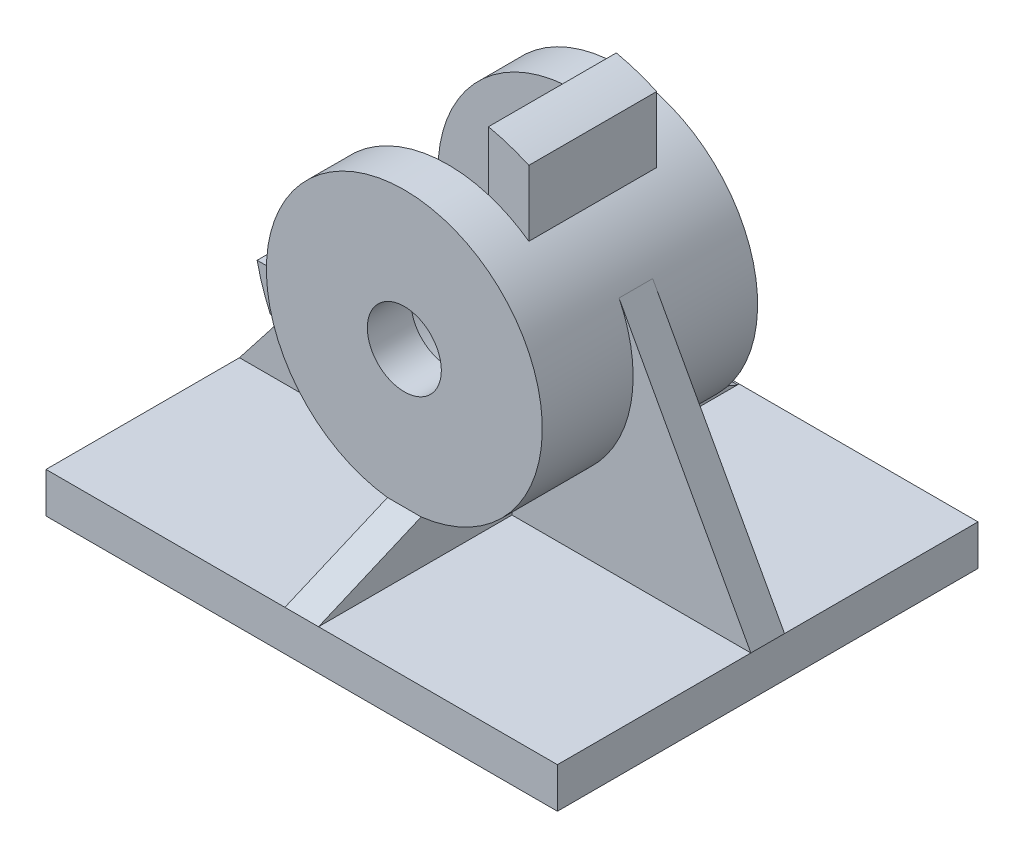
ISO-10303-21;
HEADER;
FILE_DESCRIPTION(('STEP AP214'),'2;1');
FILE_NAME('part.step','',(''),(''),'','','');
FILE_SCHEMA(('AUTOMOTIVE_DESIGN { 1 0 10303 214 1 1 1 1 }'));
ENDSEC;
DATA;
#1=APPLICATION_CONTEXT('core data for automotive mechanical design processes');
#2=APPLICATION_PROTOCOL_DEFINITION('international standard','automotive_design',2000,#1);
#3=PRODUCT_CONTEXT('',#1,'mechanical');
#4=PRODUCT('Part','Part','',(#3));
#5=PRODUCT_RELATED_PRODUCT_CATEGORY('part','',(#4));
#6=PRODUCT_DEFINITION_FORMATION('','',#4);
#7=PRODUCT_DEFINITION_CONTEXT('part definition',#1,'design');
#8=PRODUCT_DEFINITION('design','',#6,#7);
#9=PRODUCT_DEFINITION_SHAPE('','',#8);
#10=(LENGTH_UNIT() NAMED_UNIT(*) SI_UNIT(.MILLI.,.METRE.));
#11=(NAMED_UNIT(*) PLANE_ANGLE_UNIT() SI_UNIT($,.RADIAN.));
#12=(NAMED_UNIT(*) SI_UNIT($,.STERADIAN.) SOLID_ANGLE_UNIT());
#13=UNCERTAINTY_MEASURE_WITH_UNIT(LENGTH_MEASURE(1.E-05),#10,'distance_accuracy_value','');
#14=(GEOMETRIC_REPRESENTATION_CONTEXT(3) GLOBAL_UNCERTAINTY_ASSIGNED_CONTEXT((#13)) GLOBAL_UNIT_ASSIGNED_CONTEXT((#10,
#11,#12)) REPRESENTATION_CONTEXT('',''));
#15=CARTESIAN_POINT('',(0.,0.,0.));
#16=DIRECTION('',(0.,0.,1.));
#17=DIRECTION('',(1.,0.,0.));
#18=AXIS2_PLACEMENT_3D('',#15,#16,#17);
#19=CARTESIAN_POINT('',(76.,65.7098997643715,81.5));
#20=DIRECTION('',(0.,0.,-1.));
#21=DIRECTION('',(-1.,0.,0.));
#22=AXIS2_PLACEMENT_3D('',#19,#20,#21);
#23=PLANE('',#22);
#24=CARTESIAN_POINT('',(76.,65.7098997643715,81.5));
#25=DIRECTION('',(0.,0.,1.));
#26=DIRECTION('',(1.,0.,0.));
#27=AXIS2_PLACEMENT_3D('',#24,#25,#26);
#28=CIRCLE('',#27,41.);
#29=CARTESIAN_POINT('',(100.,98.9514400415608,81.5));
#30=VERTEX_POINT('',#29);
#31=CARTESIAN_POINT('',(88.,104.914491332197,81.5));
#32=VERTEX_POINT('',#31);
#33=EDGE_CURVE('E326',#30,#32,#28,.T.);
#34=ORIENTED_EDGE('',*,*,#33,.F.);
#35=DIRECTION('',(0.,-1.,0.));
#36=VECTOR('',#35,1.);
#37=CARTESIAN_POINT('',(100.,0.,81.5));
#38=LINE('',#37,#36);
#39=CARTESIAN_POINT('',(100.,118.511414894148,81.5));
#40=VERTEX_POINT('',#39);
#41=EDGE_CURVE('E880',#40,#30,#38,.T.);
#42=ORIENTED_EDGE('',*,*,#41,.F.);
#43=CARTESIAN_POINT('',(76.,65.7098997643715,81.5));
#44=DIRECTION('',(0.,0.,-1.));
#45=DIRECTION('',(-1.,0.,0.));
#46=AXIS2_PLACEMENT_3D('',#43,#44,#45);
#47=CIRCLE('',#46,58.);
#48=CARTESIAN_POINT('',(88.,122.454943600816,81.5));
#49=VERTEX_POINT('',#48);
#50=EDGE_CURVE('E422',#49,#40,#47,.T.);
#51=ORIENTED_EDGE('',*,*,#50,.F.);
#52=DIRECTION('',(0.,1.,0.));
#53=VECTOR('',#52,1.);
#54=CARTESIAN_POINT('',(88.,92.1106573292596,81.5));
#55=LINE('',#54,#53);
#56=EDGE_CURVE('E873',#32,#49,#55,.T.);
#57=ORIENTED_EDGE('',*,*,#56,.F.);
#58=EDGE_LOOP('',(#34,#42,#51,#57));
#59=FACE_BOUND('',#58,.T.);
#60=ADVANCED_FACE('F55',(#59),#23,.F.);
#61=CARTESIAN_POINT('',(36.7954084321747,53.7098997643715,81.5));
#62=VERTEX_POINT('',#61);
#63=CARTESIAN_POINT('',(42.7584597228107,41.7098997643715,81.5));
#64=VERTEX_POINT('',#63);
#65=EDGE_CURVE('E582',#62,#64,#28,.T.);
#66=ORIENTED_EDGE('',*,*,#65,.F.);
#67=DIRECTION('',(1.,0.,0.));
#68=VECTOR('',#67,1.);
#69=CARTESIAN_POINT('',(36.7954084321747,53.7098997643715,81.5));
#70=LINE('',#69,#68);
#71=CARTESIAN_POINT('',(19.2549561635556,53.7098997643715,81.5));
#72=VERTEX_POINT('',#71);
#73=EDGE_CURVE('E561',#72,#62,#70,.T.);
#74=ORIENTED_EDGE('',*,*,#73,.F.);
#75=CARTESIAN_POINT('',(76.,65.7098997643715,81.5));
#76=DIRECTION('',(0.,0.,-1.));
#77=DIRECTION('',(-1.,0.,0.));
#78=AXIS2_PLACEMENT_3D('',#75,#76,#77);
#79=CIRCLE('',#78,58.);
#80=CARTESIAN_POINT('',(23.1984848702236,41.7098997643715,81.5));
#81=VERTEX_POINT('',#80);
#82=EDGE_CURVE('E745',#81,#72,#79,.T.);
#83=ORIENTED_EDGE('',*,*,#82,.F.);
#84=DIRECTION('',(1.,0.,0.));
#85=VECTOR('',#84,1.);
#86=CARTESIAN_POINT('',(0.,41.7098997643715,81.5));
#87=LINE('',#86,#85);
#88=EDGE_CURVE('E741',#81,#64,#87,.T.);
#89=ORIENTED_EDGE('',*,*,#88,.T.);
#90=EDGE_LOOP('',(#66,#74,#83,#89));
#91=FACE_BOUND('',#90,.T.);
#92=ADVANCED_FACE('F1045',(#91),#23,.F.);
#93=CARTESIAN_POINT('',(71.,12.,125.));
#94=DIRECTION('',(1.,0.,0.));
#95=DIRECTION('',(0.,0.,-1.));
#96=AXIS2_PLACEMENT_3D('',#93,#94,#95);
#97=PLANE('',#96);
#98=DIRECTION('',(0.,0.,-1.));
#99=VECTOR('',#98,1.);
#100=CARTESIAN_POINT('',(71.,12.,125.));
#101=LINE('',#100,#99);
#102=CARTESIAN_POINT('',(71.,12.,125.));
#103=VERTEX_POINT('',#102);
#104=CARTESIAN_POINT('',(71.,12.,67.5));
#105=VERTEX_POINT('',#104);
#106=EDGE_CURVE('E344',#103,#105,#101,.T.);
#107=ORIENTED_EDGE('',*,*,#106,.F.);
#108=DIRECTION('',(0.,-0.392504670380892,0.919750011540738));
#109=VECTOR('',#108,1.);
#110=CARTESIAN_POINT('',(71.,12.,125.));
#111=LINE('',#110,#109);
#112=CARTESIAN_POINT('',(71.,25.0159198656199,94.5));
#113=VERTEX_POINT('',#112);
#114=EDGE_CURVE('E331',#113,#103,#111,.T.);
#115=ORIENTED_EDGE('',*,*,#114,.F.);
#116=DIRECTION('',(0.,0.,-1.));
#117=VECTOR('',#116,1.);
#118=CARTESIAN_POINT('',(71.,25.0159198656198,81.5));
#119=LINE('',#118,#117);
#120=CARTESIAN_POINT('',(71.,25.0159198656198,67.5));
#121=VERTEX_POINT('',#120);
#122=EDGE_CURVE('E341',#113,#121,#119,.T.);
#123=ORIENTED_EDGE('',*,*,#122,.T.);
#124=DIRECTION('',(0.,-1.,0.));
#125=VECTOR('',#124,1.);
#126=CARTESIAN_POINT('',(71.,12.,67.5));
#127=LINE('',#126,#125);
#128=EDGE_CURVE('E721',#121,#105,#127,.T.);
#129=ORIENTED_EDGE('',*,*,#128,.T.);
#130=EDGE_LOOP('',(#107,#115,#123,#129));
#131=FACE_BOUND('',#130,.T.);
#132=ADVANCED_FACE('F340',(#131),#97,.F.);
#133=CARTESIAN_POINT('',(81.,12.,125.));
#134=DIRECTION('',(-1.,0.,0.));
#135=DIRECTION('',(0.,0.,1.));
#136=AXIS2_PLACEMENT_3D('',#133,#134,#135);
#137=PLANE('',#136);
#138=DIRECTION('',(0.,0.,-1.));
#139=VECTOR('',#138,1.);
#140=CARTESIAN_POINT('',(81.,25.0159198656199,81.5));
#141=LINE('',#140,#139);
#142=CARTESIAN_POINT('',(81.,25.0159198656199,67.5));
#143=VERTEX_POINT('',#142);
#144=CARTESIAN_POINT('',(81.,25.0159198656199,94.5));
#145=VERTEX_POINT('',#144);
#146=EDGE_CURVE('E66',#143,#145,#141,.F.);
#147=ORIENTED_EDGE('',*,*,#146,.T.);
#148=DIRECTION('',(0.,-0.392504670380892,0.919750011540738));
#149=VECTOR('',#148,1.);
#150=CARTESIAN_POINT('',(81.,12.,125.));
#151=LINE('',#150,#149);
#152=CARTESIAN_POINT('',(81.,12.,125.));
#153=VERTEX_POINT('',#152);
#154=EDGE_CURVE('E334',#145,#153,#151,.T.);
#155=ORIENTED_EDGE('',*,*,#154,.T.);
#156=DIRECTION('',(0.,0.,-1.));
#157=VECTOR('',#156,1.);
#158=CARTESIAN_POINT('',(81.,12.,125.));
#159=LINE('',#158,#157);
#160=CARTESIAN_POINT('',(81.,12.,67.5));
#161=VERTEX_POINT('',#160);
#162=EDGE_CURVE('E628',#153,#161,#159,.T.);
#163=ORIENTED_EDGE('',*,*,#162,.T.);
#164=DIRECTION('',(0.,1.,0.));
#165=VECTOR('',#164,1.);
#166=CARTESIAN_POINT('',(81.,12.,67.5));
#167=LINE('',#166,#165);
#168=EDGE_CURVE('E718',#161,#143,#167,.T.);
#169=ORIENTED_EDGE('',*,*,#168,.T.);
#170=EDGE_LOOP('',(#147,#155,#163,#169));
#171=FACE_BOUND('',#170,.T.);
#172=ADVANCED_FACE('F626',(#171),#137,.F.);
#173=CARTESIAN_POINT('',(0.,0.,0.));
#174=DIRECTION('',(0.,0.,-1.));
#175=DIRECTION('',(-1.,0.,0.));
#176=AXIS2_PLACEMENT_3D('',#173,#174,#175);
#177=PLANE('',#176);
#178=DIRECTION('',(-1.,0.,0.));
#179=VECTOR('',#178,1.);
#180=CARTESIAN_POINT('',(0.,12.,0.));
#181=LINE('',#180,#179);
#182=CARTESIAN_POINT('',(81.,12.,0.));
#183=VERTEX_POINT('',#182);
#184=CARTESIAN_POINT('',(68.,12.,0.));
#185=VERTEX_POINT('',#184);
#186=EDGE_CURVE('E709',#183,#185,#181,.T.);
#187=ORIENTED_EDGE('',*,*,#186,.F.);
#188=CARTESIAN_POINT('',(152.,12.,0.));
#189=VERTEX_POINT('',#188);
#190=EDGE_CURVE('E703',#189,#183,#181,.T.);
#191=ORIENTED_EDGE('',*,*,#190,.F.);
#192=DIRECTION('',(0.,1.,0.));
#193=VECTOR('',#192,1.);
#194=CARTESIAN_POINT('',(152.,0.,0.));
#195=LINE('',#194,#193);
#196=CARTESIAN_POINT('',(152.,0.,0.));
#197=VERTEX_POINT('',#196);
#198=EDGE_CURVE('E695',#197,#189,#195,.T.);
#199=ORIENTED_EDGE('',*,*,#198,.F.);
#200=DIRECTION('',(1.,0.,0.));
#201=VECTOR('',#200,1.);
#202=CARTESIAN_POINT('',(0.,0.,0.));
#203=LINE('',#202,#201);
#204=CARTESIAN_POINT('',(0.,0.,0.));
#205=VERTEX_POINT('',#204);
#206=EDGE_CURVE('E701',#205,#197,#203,.T.);
#207=ORIENTED_EDGE('',*,*,#206,.F.);
#208=DIRECTION('',(0.,-1.,0.));
#209=VECTOR('',#208,1.);
#210=CARTESIAN_POINT('',(0.,0.,0.));
#211=LINE('',#210,#209);
#212=CARTESIAN_POINT('',(0.,12.,0.));
#213=VERTEX_POINT('',#212);
#214=EDGE_CURVE('E485',#213,#205,#211,.T.);
#215=ORIENTED_EDGE('',*,*,#214,.F.);
#216=EDGE_CURVE('E704',#185,#213,#181,.T.);
#217=ORIENTED_EDGE('',*,*,#216,.F.);
#218=EDGE_LOOP('',(#187,#191,#199,#207,#215,#217));
#219=FACE_BOUND('',#218,.T.);
#220=ADVANCED_FACE('F699',(#219),#177,.T.);
#221=CARTESIAN_POINT('',(76.,65.7098997643715,43.5));
#222=DIRECTION('',(0.,0.,-1.));
#223=DIRECTION('',(-1.,0.,0.));
#224=AXIS2_PLACEMENT_3D('',#221,#222,#223);
#225=PLANE('',#224);
#226=DIRECTION('',(0.,-1.,0.));
#227=VECTOR('',#226,1.);
#228=CARTESIAN_POINT('',(100.,0.,43.5));
#229=LINE('',#228,#227);
#230=CARTESIAN_POINT('',(100.,118.511414894148,43.5));
#231=VERTEX_POINT('',#230);
#232=CARTESIAN_POINT('',(100.,98.9514400415608,43.5));
#233=VERTEX_POINT('',#232);
#234=EDGE_CURVE('E539',#231,#233,#229,.T.);
#235=ORIENTED_EDGE('',*,*,#234,.T.);
#236=CARTESIAN_POINT('',(76.,65.7098997643715,43.5));
#237=DIRECTION('',(0.,0.,-1.));
#238=DIRECTION('',(-1.,0.,0.));
#239=AXIS2_PLACEMENT_3D('',#236,#237,#238);
#240=CIRCLE('',#239,41.);
#241=CARTESIAN_POINT('',(88.,104.914491332197,43.5));
#242=VERTEX_POINT('',#241);
#243=EDGE_CURVE('E77',#242,#233,#240,.T.);
#244=ORIENTED_EDGE('',*,*,#243,.F.);
#245=DIRECTION('',(0.,1.,0.));
#246=VECTOR('',#245,1.);
#247=CARTESIAN_POINT('',(88.,92.1106573292596,43.5));
#248=LINE('',#247,#246);
#249=CARTESIAN_POINT('',(88.,122.454943600816,43.5));
#250=VERTEX_POINT('',#249);
#251=EDGE_CURVE('E909',#242,#250,#248,.T.);
#252=ORIENTED_EDGE('',*,*,#251,.T.);
#253=CARTESIAN_POINT('',(76.,65.7098997643715,43.5));
#254=DIRECTION('',(0.,0.,-1.));
#255=DIRECTION('',(-1.,0.,0.));
#256=AXIS2_PLACEMENT_3D('',#253,#254,#255);
#257=CIRCLE('',#256,58.);
#258=EDGE_CURVE('E421',#250,#231,#257,.T.);
#259=ORIENTED_EDGE('',*,*,#258,.T.);
#260=EDGE_LOOP('',(#235,#244,#252,#259));
#261=FACE_BOUND('',#260,.T.);
#262=ADVANCED_FACE('F908',(#261),#225,.T.);
#263=DIRECTION('',(1.,0.,0.));
#264=VECTOR('',#263,1.);
#265=CARTESIAN_POINT('',(36.7954084321747,53.7098997643715,43.5));
#266=LINE('',#265,#264);
#267=CARTESIAN_POINT('',(19.2549561635556,53.7098997643715,43.5));
#268=VERTEX_POINT('',#267);
#269=CARTESIAN_POINT('',(36.7954084321747,53.7098997643715,43.5));
#270=VERTEX_POINT('',#269);
#271=EDGE_CURVE('E929',#268,#270,#266,.T.);
#272=ORIENTED_EDGE('',*,*,#271,.T.);
#273=CARTESIAN_POINT('',(42.7584597228107,41.7098997643715,43.5));
#274=VERTEX_POINT('',#273);
#275=EDGE_CURVE('E769',#274,#270,#240,.T.);
#276=ORIENTED_EDGE('',*,*,#275,.F.);
#277=DIRECTION('',(1.,0.,0.));
#278=VECTOR('',#277,1.);
#279=CARTESIAN_POINT('',(0.,41.7098997643715,43.5));
#280=LINE('',#279,#278);
#281=CARTESIAN_POINT('',(23.1984848702236,41.7098997643715,43.5));
#282=VERTEX_POINT('',#281);
#283=EDGE_CURVE('E754',#282,#274,#280,.T.);
#284=ORIENTED_EDGE('',*,*,#283,.F.);
#285=CARTESIAN_POINT('',(76.,65.7098997643715,43.5));
#286=DIRECTION('',(0.,0.,-1.));
#287=DIRECTION('',(-1.,0.,0.));
#288=AXIS2_PLACEMENT_3D('',#285,#286,#287);
#289=CIRCLE('',#288,58.);
#290=EDGE_CURVE('E746',#282,#268,#289,.T.);
#291=ORIENTED_EDGE('',*,*,#290,.T.);
#292=EDGE_LOOP('',(#272,#276,#284,#291));
#293=FACE_BOUND('',#292,.T.);
#294=ADVANCED_FACE('F1051',(#293),#225,.T.);
#295=CARTESIAN_POINT('',(152.,12.,67.5));
#296=DIRECTION('',(0.,0.,-1.));
#297=DIRECTION('',(-1.,0.,0.));
#298=AXIS2_PLACEMENT_3D('',#295,#296,#297);
#299=PLANE('',#298);
#300=DIRECTION('',(1.,0.,0.));
#301=VECTOR('',#300,1.);
#302=CARTESIAN_POINT('',(152.,41.7098997643714,67.5));
#303=LINE('',#302,#301);
#304=CARTESIAN_POINT('',(23.1984848702236,41.7098997643715,67.5));
#305=VERTEX_POINT('',#304);
#306=CARTESIAN_POINT('',(42.7584597228107,41.7098997643715,67.5));
#307=VERTEX_POINT('',#306);
#308=EDGE_CURVE('E412',#305,#307,#303,.T.);
#309=ORIENTED_EDGE('',*,*,#308,.F.);
#310=DIRECTION('',(-0.615440163783903,-0.788183611096833,0.));
#311=VECTOR('',#310,1.);
#312=CARTESIAN_POINT('',(57.5725224701502,85.7321373071938,67.5));
#313=LINE('',#312,#311);
#314=CARTESIAN_POINT('',(0.,12.,67.5));
#315=VERTEX_POINT('',#314);
#316=EDGE_CURVE('E393',#305,#315,#313,.T.);
#317=ORIENTED_EDGE('',*,*,#316,.T.);
#318=DIRECTION('',(-1.,0.,0.));
#319=VECTOR('',#318,1.);
#320=CARTESIAN_POINT('',(152.,12.,67.5));
#321=LINE('',#320,#319);
#322=EDGE_CURVE('E468',#105,#315,#321,.T.);
#323=ORIENTED_EDGE('',*,*,#322,.F.);
#324=ORIENTED_EDGE('',*,*,#128,.F.);
#325=CARTESIAN_POINT('',(76.,65.7098997643715,67.5));
#326=DIRECTION('',(0.,0.,-1.));
#327=DIRECTION('',(-1.,0.,0.));
#328=AXIS2_PLACEMENT_3D('',#325,#326,#327);
#329=CIRCLE('',#328,41.);
#330=EDGE_CURVE('E351',#121,#307,#329,.T.);
#331=ORIENTED_EDGE('',*,*,#330,.T.);
#332=EDGE_LOOP('',(#309,#317,#323,#324,#331));
#333=FACE_BOUND('',#332,.T.);
#334=ADVANCED_FACE('F467',(#333),#299,.F.);
#335=CARTESIAN_POINT('',(152.,12.,57.5));
#336=DIRECTION('',(0.,0.,1.));
#337=DIRECTION('',(1.,0.,0.));
#338=AXIS2_PLACEMENT_3D('',#335,#336,#337);
#339=PLANE('',#338);
#340=DIRECTION('',(-1.,0.,0.));
#341=VECTOR('',#340,1.);
#342=CARTESIAN_POINT('',(152.,12.,57.5));
#343=LINE('',#342,#341);
#344=CARTESIAN_POINT('',(71.,12.,57.5));
#345=VERTEX_POINT('',#344);
#346=CARTESIAN_POINT('',(0.,12.,57.5));
#347=VERTEX_POINT('',#346);
#348=EDGE_CURVE('E488',#345,#347,#343,.T.);
#349=ORIENTED_EDGE('',*,*,#348,.T.);
#350=DIRECTION('',(0.615440163783903,0.788183611096833,0.));
#351=VECTOR('',#350,1.);
#352=CARTESIAN_POINT('',(57.5725224701502,85.7321373071938,57.5));
#353=LINE('',#352,#351);
#354=CARTESIAN_POINT('',(23.1984848702236,41.7098997643715,57.5));
#355=VERTEX_POINT('',#354);
#356=EDGE_CURVE('E389',#347,#355,#353,.T.);
#357=ORIENTED_EDGE('',*,*,#356,.T.);
#358=DIRECTION('',(-1.,0.,0.));
#359=VECTOR('',#358,1.);
#360=CARTESIAN_POINT('',(152.,41.7098997643714,57.5));
#361=LINE('',#360,#359);
#362=CARTESIAN_POINT('',(42.7584597228107,41.7098997643715,57.5));
#363=VERTEX_POINT('',#362);
#364=EDGE_CURVE('E406',#363,#355,#361,.T.);
#365=ORIENTED_EDGE('',*,*,#364,.F.);
#366=CARTESIAN_POINT('',(76.,65.7098997643715,57.5));
#367=DIRECTION('',(0.,0.,1.));
#368=DIRECTION('',(1.,0.,0.));
#369=AXIS2_PLACEMENT_3D('',#366,#367,#368);
#370=CIRCLE('',#369,41.);
#371=CARTESIAN_POINT('',(71.,25.0159198656198,57.5));
#372=VERTEX_POINT('',#371);
#373=EDGE_CURVE('E642',#363,#372,#370,.T.);
#374=ORIENTED_EDGE('',*,*,#373,.T.);
#375=DIRECTION('',(0.,1.,0.));
#376=VECTOR('',#375,1.);
#377=CARTESIAN_POINT('',(71.,12.,57.5));
#378=LINE('',#377,#376);
#379=EDGE_CURVE('E491',#345,#372,#378,.T.);
#380=ORIENTED_EDGE('',*,*,#379,.F.);
#381=EDGE_LOOP('',(#349,#357,#365,#374,#380));
#382=FACE_BOUND('',#381,.T.);
#383=ADVANCED_FACE('F1073',(#382),#339,.F.);
#384=CARTESIAN_POINT('',(152.,12.,67.5));
#385=VERTEX_POINT('',#384);
#386=EDGE_CURVE('E479',#385,#161,#321,.T.);
#387=ORIENTED_EDGE('',*,*,#386,.F.);
#388=DIRECTION('',(-0.479273295000565,0.877665715804885,0.));
#389=VECTOR('',#388,1.);
#390=CARTESIAN_POINT('',(152.,12.,67.5));
#391=LINE('',#390,#389);
#392=CARTESIAN_POINT('',(112.808217889247,83.7696643203587,67.5));
#393=VERTEX_POINT('',#392);
#394=EDGE_CURVE('E441',#385,#393,#391,.T.);
#395=ORIENTED_EDGE('',*,*,#394,.T.);
#396=EDGE_CURVE('E359',#393,#143,#329,.T.);
#397=ORIENTED_EDGE('',*,*,#396,.T.);
#398=ORIENTED_EDGE('',*,*,#168,.F.);
#399=EDGE_LOOP('',(#387,#395,#397,#398));
#400=FACE_BOUND('',#399,.T.);
#401=ADVANCED_FACE('F1071',(#400),#299,.F.);
#402=CARTESIAN_POINT('',(81.,25.0159198656199,57.5));
#403=VERTEX_POINT('',#402);
#404=CARTESIAN_POINT('',(112.808217889247,83.7696643203586,57.5));
#405=VERTEX_POINT('',#404);
#406=EDGE_CURVE('E361',#403,#405,#370,.T.);
#407=ORIENTED_EDGE('',*,*,#406,.T.);
#408=DIRECTION('',(-0.479273295000565,0.877665715804885,0.));
#409=VECTOR('',#408,1.);
#410=CARTESIAN_POINT('',(152.,12.,57.5));
#411=LINE('',#410,#409);
#412=CARTESIAN_POINT('',(152.,12.,57.5));
#413=VERTEX_POINT('',#412);
#414=EDGE_CURVE('E452',#413,#405,#411,.T.);
#415=ORIENTED_EDGE('',*,*,#414,.F.);
#416=CARTESIAN_POINT('',(81.,12.,57.5));
#417=VERTEX_POINT('',#416);
#418=EDGE_CURVE('E480',#413,#417,#343,.T.);
#419=ORIENTED_EDGE('',*,*,#418,.T.);
#420=DIRECTION('',(0.,-1.,0.));
#421=VECTOR('',#420,1.);
#422=CARTESIAN_POINT('',(81.,12.,57.5));
#423=LINE('',#422,#421);
#424=EDGE_CURVE('E676',#403,#417,#423,.T.);
#425=ORIENTED_EDGE('',*,*,#424,.F.);
#426=EDGE_LOOP('',(#407,#415,#419,#425));
#427=FACE_BOUND('',#426,.T.);
#428=ADVANCED_FACE('F1064',(#427),#339,.F.);
#429=CARTESIAN_POINT('',(0.,12.,125.));
#430=DIRECTION('',(0.,-1.,0.));
#431=DIRECTION('',(0.,0.,-1.));
#432=AXIS2_PLACEMENT_3D('',#429,#430,#431);
#433=PLANE('',#432);
#434=CARTESIAN_POINT('',(71.,12.,0.628700506244528));
#435=VERTEX_POINT('',#434);
#436=EDGE_CURVE('E633',#345,#435,#101,.T.);
#437=ORIENTED_EDGE('',*,*,#436,.T.);
#438=DIRECTION('',(-1.,0.,0.));
#439=VECTOR('',#438,1.);
#440=CARTESIAN_POINT('',(0.,12.,0.628700506244514));
#441=LINE('',#440,#439);
#442=CARTESIAN_POINT('',(68.,12.,0.628700506244567));
#443=VERTEX_POINT('',#442);
#444=EDGE_CURVE('E789',#435,#443,#441,.T.);
#445=ORIENTED_EDGE('',*,*,#444,.T.);
#446=DIRECTION('',(0.,0.,1.));
#447=VECTOR('',#446,1.);
#448=CARTESIAN_POINT('',(68.,12.,125.));
#449=LINE('',#448,#447);
#450=EDGE_CURVE('E814',#185,#443,#449,.T.);
#451=ORIENTED_EDGE('',*,*,#450,.F.);
#452=ORIENTED_EDGE('',*,*,#216,.T.);
#453=DIRECTION('',(0.,0.,-1.));
#454=VECTOR('',#453,1.);
#455=CARTESIAN_POINT('',(0.,12.,125.));
#456=LINE('',#455,#454);
#457=EDGE_CURVE('E526',#347,#213,#456,.T.);
#458=ORIENTED_EDGE('',*,*,#457,.F.);
#459=ORIENTED_EDGE('',*,*,#348,.F.);
#460=EDGE_LOOP('',(#437,#445,#451,#452,#458,#459));
#461=FACE_BOUND('',#460,.T.);
#462=ADVANCED_FACE('F833',(#461),#433,.F.);
#463=CARTESIAN_POINT('',(81.,12.,0.628700506244531));
#464=VERTEX_POINT('',#463);
#465=EDGE_CURVE('E634',#417,#464,#159,.T.);
#466=ORIENTED_EDGE('',*,*,#465,.F.);
#467=ORIENTED_EDGE('',*,*,#418,.F.);
#468=DIRECTION('',(0.,0.,-1.));
#469=VECTOR('',#468,1.);
#470=CARTESIAN_POINT('',(152.,12.,125.));
#471=LINE('',#470,#469);
#472=EDGE_CURVE('E662',#413,#189,#471,.T.);
#473=ORIENTED_EDGE('',*,*,#472,.T.);
#474=ORIENTED_EDGE('',*,*,#190,.T.);
#475=DIRECTION('',(0.,0.,1.));
#476=VECTOR('',#475,1.);
#477=CARTESIAN_POINT('',(81.,12.,125.));
#478=LINE('',#477,#476);
#479=EDGE_CURVE('E809',#183,#464,#478,.T.);
#480=ORIENTED_EDGE('',*,*,#479,.T.);
#481=EDGE_LOOP('',(#466,#467,#473,#474,#480));
#482=FACE_BOUND('',#481,.T.);
#483=ADVANCED_FACE('F1268',(#482),#433,.F.);
#484=ORIENTED_EDGE('',*,*,#106,.T.);
#485=ORIENTED_EDGE('',*,*,#322,.T.);
#486=CARTESIAN_POINT('',(0.,12.,125.));
#487=VERTEX_POINT('',#486);
#488=EDGE_CURVE('E477',#487,#315,#456,.T.);
#489=ORIENTED_EDGE('',*,*,#488,.F.);
#490=DIRECTION('',(-1.,0.,0.));
#491=VECTOR('',#490,1.);
#492=CARTESIAN_POINT('',(0.,12.,125.));
#493=LINE('',#492,#491);
#494=EDGE_CURVE('E519',#103,#487,#493,.T.);
#495=ORIENTED_EDGE('',*,*,#494,.F.);
#496=EDGE_LOOP('',(#484,#485,#489,#495));
#497=FACE_BOUND('',#496,.T.);
#498=ADVANCED_FACE('F475',(#497),#433,.F.);
#499=ORIENTED_EDGE('',*,*,#162,.F.);
#500=CARTESIAN_POINT('',(152.,12.,125.));
#501=VERTEX_POINT('',#500);
#502=EDGE_CURVE('E522',#501,#153,#493,.T.);
#503=ORIENTED_EDGE('',*,*,#502,.F.);
#504=EDGE_CURVE('E665',#501,#385,#471,.T.);
#505=ORIENTED_EDGE('',*,*,#504,.T.);
#506=ORIENTED_EDGE('',*,*,#386,.T.);
#507=EDGE_LOOP('',(#499,#503,#505,#506));
#508=FACE_BOUND('',#507,.T.);
#509=ADVANCED_FACE('F631',(#508),#433,.F.);
#510=CARTESIAN_POINT('',(0.,0.,125.));
#511=DIRECTION('',(1.,0.,0.));
#512=DIRECTION('',(0.,0.,-1.));
#513=AXIS2_PLACEMENT_3D('',#510,#511,#512);
#514=PLANE('',#513);
#515=ORIENTED_EDGE('',*,*,#488,.T.);
#516=DIRECTION('',(0.,0.,-1.));
#517=VECTOR('',#516,1.);
#518=CARTESIAN_POINT('',(0.,12.,81.5));
#519=LINE('',#518,#517);
#520=EDGE_CURVE('E385',#315,#347,#519,.T.);
#521=ORIENTED_EDGE('',*,*,#520,.T.);
#522=ORIENTED_EDGE('',*,*,#457,.T.);
#523=ORIENTED_EDGE('',*,*,#214,.T.);
#524=DIRECTION('',(0.,0.,-1.));
#525=VECTOR('',#524,1.);
#526=CARTESIAN_POINT('',(0.,0.,125.));
#527=LINE('',#526,#525);
#528=CARTESIAN_POINT('',(0.,0.,125.));
#529=VERTEX_POINT('',#528);
#530=EDGE_CURVE('E672',#529,#205,#527,.T.);
#531=ORIENTED_EDGE('',*,*,#530,.F.);
#532=DIRECTION('',(0.,-1.,0.));
#533=VECTOR('',#532,1.);
#534=CARTESIAN_POINT('',(0.,0.,125.));
#535=LINE('',#534,#533);
#536=EDGE_CURVE('E498',#487,#529,#535,.T.);
#537=ORIENTED_EDGE('',*,*,#536,.F.);
#538=EDGE_LOOP('',(#515,#521,#522,#523,#531,#537));
#539=FACE_BOUND('',#538,.T.);
#540=ADVANCED_FACE('F58',(#539),#514,.F.);
#541=CARTESIAN_POINT('',(0.,0.,125.));
#542=DIRECTION('',(0.,1.,0.));
#543=DIRECTION('',(0.,0.,1.));
#544=AXIS2_PLACEMENT_3D('',#541,#542,#543);
#545=PLANE('',#544);
#546=ORIENTED_EDGE('',*,*,#206,.T.);
#547=DIRECTION('',(0.,0.,-1.));
#548=VECTOR('',#547,1.);
#549=CARTESIAN_POINT('',(152.,0.,125.));
#550=LINE('',#549,#548);
#551=CARTESIAN_POINT('',(152.,0.,125.));
#552=VERTEX_POINT('',#551);
#553=EDGE_CURVE('E658',#552,#197,#550,.T.);
#554=ORIENTED_EDGE('',*,*,#553,.F.);
#555=DIRECTION('',(1.,0.,0.));
#556=VECTOR('',#555,1.);
#557=CARTESIAN_POINT('',(0.,0.,125.));
#558=LINE('',#557,#556);
#559=EDGE_CURVE('E520',#529,#552,#558,.T.);
#560=ORIENTED_EDGE('',*,*,#559,.F.);
#561=ORIENTED_EDGE('',*,*,#530,.T.);
#562=EDGE_LOOP('',(#546,#554,#560,#561));
#563=FACE_BOUND('',#562,.T.);
#564=ADVANCED_FACE('F1409',(#563),#545,.F.);
#565=CARTESIAN_POINT('',(152.,0.,125.));
#566=DIRECTION('',(-1.,0.,0.));
#567=DIRECTION('',(0.,0.,1.));
#568=AXIS2_PLACEMENT_3D('',#565,#566,#567);
#569=PLANE('',#568);
#570=ORIENTED_EDGE('',*,*,#472,.F.);
#571=DIRECTION('',(0.,0.,-1.));
#572=VECTOR('',#571,1.);
#573=CARTESIAN_POINT('',(152.,12.,95.5));
#574=LINE('',#573,#572);
#575=EDGE_CURVE('E442',#385,#413,#574,.T.);
#576=ORIENTED_EDGE('',*,*,#575,.F.);
#577=ORIENTED_EDGE('',*,*,#504,.F.);
#578=DIRECTION('',(0.,1.,0.));
#579=VECTOR('',#578,1.);
#580=CARTESIAN_POINT('',(152.,0.,125.));
#581=LINE('',#580,#579);
#582=EDGE_CURVE('E515',#552,#501,#581,.T.);
#583=ORIENTED_EDGE('',*,*,#582,.F.);
#584=ORIENTED_EDGE('',*,*,#553,.T.);
#585=ORIENTED_EDGE('',*,*,#198,.T.);
#586=EDGE_LOOP('',(#570,#576,#577,#583,#584,#585));
#587=FACE_BOUND('',#586,.T.);
#588=ADVANCED_FACE('F694',(#587),#569,.F.);
#589=CARTESIAN_POINT('',(0.,0.,125.));
#590=DIRECTION('',(0.,0.,-1.));
#591=DIRECTION('',(-1.,0.,0.));
#592=AXIS2_PLACEMENT_3D('',#589,#590,#591);
#593=PLANE('',#592);
#594=ORIENTED_EDGE('',*,*,#502,.T.);
#595=DIRECTION('',(-1.,0.,0.));
#596=VECTOR('',#595,1.);
#597=CARTESIAN_POINT('',(84.,12.,125.));
#598=LINE('',#597,#596);
#599=EDGE_CURVE('E336',#153,#103,#598,.T.);
#600=ORIENTED_EDGE('',*,*,#599,.T.);
#601=ORIENTED_EDGE('',*,*,#494,.T.);
#602=ORIENTED_EDGE('',*,*,#536,.T.);
#603=ORIENTED_EDGE('',*,*,#559,.T.);
#604=ORIENTED_EDGE('',*,*,#582,.T.);
#605=EDGE_LOOP('',(#594,#600,#601,#602,#603,#604));
#606=FACE_BOUND('',#605,.T.);
#607=ADVANCED_FACE('F1128',(#606),#593,.F.);
#608=DIRECTION('',(0.,0.,-1.));
#609=VECTOR('',#608,1.);
#610=CARTESIAN_POINT('',(71.,25.0159198656198,81.5));
#611=LINE('',#610,#609);
#612=CARTESIAN_POINT('',(70.9999999999999,25.0159198656199,30.5));
#613=VERTEX_POINT('',#612);
#614=EDGE_CURVE('E357',#372,#613,#611,.T.);
#615=ORIENTED_EDGE('',*,*,#614,.T.);
#616=DIRECTION('',(0.,-0.399458969571604,-0.916751073971988));
#617=VECTOR('',#616,1.);
#618=CARTESIAN_POINT('',(71.,57.5453220038977,105.154386601744));
#619=LINE('',#618,#617);
#620=EDGE_CURVE('E817',#613,#435,#619,.T.);
#621=ORIENTED_EDGE('',*,*,#620,.T.);
#622=ORIENTED_EDGE('',*,*,#436,.F.);
#623=ORIENTED_EDGE('',*,*,#379,.T.);
#624=EDGE_LOOP('',(#615,#621,#622,#623));
#625=FACE_BOUND('',#624,.T.);
#626=ADVANCED_FACE('F1125',(#625),#97,.F.);
#627=ORIENTED_EDGE('',*,*,#465,.T.);
#628=DIRECTION('',(0.,-0.399458969571604,-0.916751073971988));
#629=VECTOR('',#628,1.);
#630=CARTESIAN_POINT('',(81.,9.8549574631293,-4.294133124205));
#631=LINE('',#630,#629);
#632=CARTESIAN_POINT('',(81.,25.0159198656199,30.5));
#633=VERTEX_POINT('',#632);
#634=EDGE_CURVE('E852',#633,#464,#631,.T.);
#635=ORIENTED_EDGE('',*,*,#634,.F.);
#636=DIRECTION('',(0.,0.,-1.));
#637=VECTOR('',#636,1.);
#638=CARTESIAN_POINT('',(81.,25.0159198656199,81.5));
#639=LINE('',#638,#637);
#640=EDGE_CURVE('E353',#633,#403,#639,.F.);
#641=ORIENTED_EDGE('',*,*,#640,.T.);
#642=ORIENTED_EDGE('',*,*,#424,.T.);
#643=EDGE_LOOP('',(#627,#635,#641,#642));
#644=FACE_BOUND('',#643,.T.);
#645=ADVANCED_FACE('F1110',(#644),#137,.F.);
#646=CARTESIAN_POINT('',(76.,65.7098997643715,81.5));
#647=DIRECTION('',(0.,0.,-1.));
#648=DIRECTION('',(-1.,0.,0.));
#649=AXIS2_PLACEMENT_3D('',#646,#647,#648);
#650=CYLINDRICAL_SURFACE('',#649,41.);
#651=ORIENTED_EDGE('',*,*,#396,.F.);
#652=DIRECTION('',(0.,0.,-1.));
#653=VECTOR('',#652,1.);
#654=CARTESIAN_POINT('',(112.808217889247,83.7696643203587,95.5));
#655=LINE('',#654,#653);
#656=EDGE_CURVE('E435',#393,#405,#655,.T.);
#657=ORIENTED_EDGE('',*,*,#656,.T.);
#658=ORIENTED_EDGE('',*,*,#406,.F.);
#659=ORIENTED_EDGE('',*,*,#640,.F.);
#660=CARTESIAN_POINT('',(76.,65.7098997643715,30.5));
#661=DIRECTION('',(0.,0.,-1.));
#662=DIRECTION('',(-1.,0.,0.));
#663=AXIS2_PLACEMENT_3D('',#660,#661,#662);
#664=CIRCLE('',#663,41.);
#665=EDGE_CURVE('E768',#613,#633,#664,.T.);
#666=ORIENTED_EDGE('',*,*,#665,.F.);
#667=ORIENTED_EDGE('',*,*,#614,.F.);
#668=ORIENTED_EDGE('',*,*,#373,.F.);
#669=DIRECTION('',(0.,0.,-1.));
#670=VECTOR('',#669,1.);
#671=CARTESIAN_POINT('',(42.7584597228107,41.7098997643715,81.5));
#672=LINE('',#671,#670);
#673=EDGE_CURVE('E12',#363,#274,#672,.T.);
#674=ORIENTED_EDGE('',*,*,#673,.T.);
#675=ORIENTED_EDGE('',*,*,#275,.T.);
#676=EDGE_CURVE('E770',#270,#242,#240,.T.);
#677=ORIENTED_EDGE('',*,*,#676,.T.);
#678=ORIENTED_EDGE('',*,*,#243,.T.);
#679=DIRECTION('',(0.,0.,-1.));
#680=VECTOR('',#679,1.);
#681=CARTESIAN_POINT('',(100.,98.9514400415608,81.5));
#682=LINE('',#681,#680);
#683=EDGE_CURVE('E545',#30,#233,#682,.T.);
#684=ORIENTED_EDGE('',*,*,#683,.F.);
#685=ORIENTED_EDGE('',*,*,#33,.T.);
#686=EDGE_CURVE('E581',#32,#62,#28,.T.);
#687=ORIENTED_EDGE('',*,*,#686,.T.);
#688=ORIENTED_EDGE('',*,*,#65,.T.);
#689=DIRECTION('',(0.,0.,-1.));
#690=VECTOR('',#689,1.);
#691=CARTESIAN_POINT('',(42.7584597228107,41.7098997643715,81.5));
#692=LINE('',#691,#690);
#693=EDGE_CURVE('E413',#64,#307,#692,.T.);
#694=ORIENTED_EDGE('',*,*,#693,.T.);
#695=ORIENTED_EDGE('',*,*,#330,.F.);
#696=ORIENTED_EDGE('',*,*,#122,.F.);
#697=CARTESIAN_POINT('',(76.,65.7098997643715,94.5));
#698=DIRECTION('',(0.,0.,1.));
#699=DIRECTION('',(1.,0.,0.));
#700=AXIS2_PLACEMENT_3D('',#697,#698,#699);
#701=CIRCLE('',#700,41.);
#702=EDGE_CURVE('E315',#145,#113,#701,.T.);
#703=ORIENTED_EDGE('',*,*,#702,.F.);
#704=ORIENTED_EDGE('',*,*,#146,.F.);
#705=EDGE_LOOP('',(#651,#657,#658,#659,#666,#667,#668,#674,#675,#677,#678,#684,#685,#687,#688,
#694,#695,#696,#703,#704));
#706=FACE_BOUND('',#705,.T.);
#707=ADVANCED_FACE('F349',(#706),#650,.T.);
#708=CARTESIAN_POINT('',(76.,65.7098997643715,81.5));
#709=DIRECTION('',(0.,0.,-1.));
#710=DIRECTION('',(-1.,0.,0.));
#711=AXIS2_PLACEMENT_3D('',#708,#709,#710);
#712=CYLINDRICAL_SURFACE('',#711,29.);
#713=CARTESIAN_POINT('',(76.,65.7098997643715,43.5));
#714=DIRECTION('',(0.,0.,1.));
#715=DIRECTION('',(-1.,0.,0.));
#716=AXIS2_PLACEMENT_3D('',#713,#714,#715);
#717=CIRCLE('',#716,29.);
#718=CARTESIAN_POINT('',(49.5992424351118,53.7098997643715,43.5));
#719=VERTEX_POINT('',#718);
#720=CARTESIAN_POINT('',(88.,92.1106573292596,43.5));
#721=VERTEX_POINT('',#720);
#722=EDGE_CURVE('E549',#719,#721,#717,.T.);
#723=ORIENTED_EDGE('',*,*,#722,.F.);
#724=DIRECTION('',(0.,0.,-1.));
#725=VECTOR('',#724,1.);
#726=CARTESIAN_POINT('',(49.5992424351118,53.7098997643715,81.5));
#727=LINE('',#726,#725);
#728=CARTESIAN_POINT('',(49.5992424351118,53.7098997643715,81.5));
#729=VERTEX_POINT('',#728);
#730=EDGE_CURVE('E560',#729,#719,#727,.T.);
#731=ORIENTED_EDGE('',*,*,#730,.F.);
#732=CARTESIAN_POINT('',(76.,65.7098997643715,81.5));
#733=DIRECTION('',(0.,0.,1.));
#734=DIRECTION('',(-1.,0.,0.));
#735=AXIS2_PLACEMENT_3D('',#732,#733,#734);
#736=CIRCLE('',#735,29.);
#737=CARTESIAN_POINT('',(88.,92.1106573292596,81.5));
#738=VERTEX_POINT('',#737);
#739=EDGE_CURVE('E874',#729,#738,#736,.T.);
#740=ORIENTED_EDGE('',*,*,#739,.T.);
#741=DIRECTION('',(0.,0.,-1.));
#742=VECTOR('',#741,1.);
#743=CARTESIAN_POINT('',(88.,92.1106573292596,81.5));
#744=LINE('',#743,#742);
#745=EDGE_CURVE('E556',#738,#721,#744,.T.);
#746=ORIENTED_EDGE('',*,*,#745,.T.);
#747=EDGE_LOOP('',(#723,#731,#740,#746));
#748=FACE_BOUND('',#747,.T.);
#749=ADVANCED_FACE('F1109',(#748),#712,.F.);
#750=CARTESIAN_POINT('',(88.,92.1106573292596,81.5));
#751=DIRECTION('',(-1.,0.,0.));
#752=DIRECTION('',(0.,0.,1.));
#753=AXIS2_PLACEMENT_3D('',#750,#751,#752);
#754=PLANE('',#753);
#755=ORIENTED_EDGE('',*,*,#745,.F.);
#756=EDGE_CURVE('E869',#738,#32,#55,.T.);
#757=ORIENTED_EDGE('',*,*,#756,.T.);
#758=ORIENTED_EDGE('',*,*,#56,.T.);
#759=DIRECTION('',(0.,0.,-1.));
#760=VECTOR('',#759,1.);
#761=CARTESIAN_POINT('',(88.,122.454943600816,81.5));
#762=LINE('',#761,#760);
#763=EDGE_CURVE('E884',#49,#250,#762,.T.);
#764=ORIENTED_EDGE('',*,*,#763,.T.);
#765=ORIENTED_EDGE('',*,*,#251,.F.);
#766=EDGE_CURVE('E926',#721,#242,#248,.T.);
#767=ORIENTED_EDGE('',*,*,#766,.F.);
#768=EDGE_LOOP('',(#755,#757,#758,#764,#765,#767));
#769=FACE_BOUND('',#768,.T.);
#770=ADVANCED_FACE('F1103',(#769),#754,.T.);
#771=CARTESIAN_POINT('',(36.7954084321747,53.7098997643715,81.5));
#772=DIRECTION('',(0.,1.,0.));
#773=DIRECTION('',(0.,0.,1.));
#774=AXIS2_PLACEMENT_3D('',#771,#772,#773);
#775=PLANE('',#774);
#776=ORIENTED_EDGE('',*,*,#730,.T.);
#777=DIRECTION('',(-1.,0.,0.));
#778=VECTOR('',#777,1.);
#779=CARTESIAN_POINT('',(36.7954084321747,53.7098997643715,43.5));
#780=LINE('',#779,#778);
#781=EDGE_CURVE('E88',#719,#270,#780,.T.);
#782=ORIENTED_EDGE('',*,*,#781,.T.);
#783=ORIENTED_EDGE('',*,*,#271,.F.);
#784=DIRECTION('',(0.,0.,-1.));
#785=VECTOR('',#784,1.);
#786=CARTESIAN_POINT('',(19.2549561635556,53.7098997643715,81.5));
#787=LINE('',#786,#785);
#788=EDGE_CURVE('E977',#72,#268,#787,.T.);
#789=ORIENTED_EDGE('',*,*,#788,.F.);
#790=ORIENTED_EDGE('',*,*,#73,.T.);
#791=DIRECTION('',(1.,0.,0.));
#792=VECTOR('',#791,1.);
#793=CARTESIAN_POINT('',(36.7954084321747,53.7098997643715,81.5));
#794=LINE('',#793,#792);
#795=EDGE_CURVE('E325',#62,#729,#794,.T.);
#796=ORIENTED_EDGE('',*,*,#795,.T.);
#797=EDGE_LOOP('',(#776,#782,#783,#789,#790,#796));
#798=FACE_BOUND('',#797,.T.);
#799=ADVANCED_FACE('F1047',(#798),#775,.T.);
#800=CARTESIAN_POINT('',(100.,0.,81.5));
#801=DIRECTION('',(1.,0.,0.));
#802=DIRECTION('',(0.,0.,-1.));
#803=AXIS2_PLACEMENT_3D('',#800,#801,#802);
#804=PLANE('',#803);
#805=ORIENTED_EDGE('',*,*,#234,.F.);
#806=DIRECTION('',(0.,0.,-1.));
#807=VECTOR('',#806,1.);
#808=CARTESIAN_POINT('',(100.,118.511414894148,81.5));
#809=LINE('',#808,#807);
#810=EDGE_CURVE('E550',#40,#231,#809,.T.);
#811=ORIENTED_EDGE('',*,*,#810,.F.);
#812=ORIENTED_EDGE('',*,*,#41,.T.);
#813=ORIENTED_EDGE('',*,*,#683,.T.);
#814=EDGE_LOOP('',(#805,#811,#812,#813));
#815=FACE_BOUND('',#814,.T.);
#816=ADVANCED_FACE('F907',(#815),#804,.T.);
#817=CARTESIAN_POINT('',(76.,65.7098997643715,81.5));
#818=DIRECTION('',(0.,0.,-1.));
#819=DIRECTION('',(-1.,0.,0.));
#820=AXIS2_PLACEMENT_3D('',#817,#818,#819);
#821=CYLINDRICAL_SURFACE('',#820,58.);
#822=ORIENTED_EDGE('',*,*,#258,.F.);
#823=ORIENTED_EDGE('',*,*,#763,.F.);
#824=ORIENTED_EDGE('',*,*,#50,.T.);
#825=ORIENTED_EDGE('',*,*,#810,.T.);
#826=EDGE_LOOP('',(#822,#823,#824,#825));
#827=FACE_BOUND('',#826,.T.);
#828=ADVANCED_FACE('F899',(#827),#821,.T.);
#829=CARTESIAN_POINT('',(0.,41.7098997643715,81.5));
#830=DIRECTION('',(0.,1.,0.));
#831=DIRECTION('',(-1.,0.,0.));
#832=AXIS2_PLACEMENT_3D('',#829,#830,#831);
#833=PLANE('',#832);
#834=ORIENTED_EDGE('',*,*,#673,.F.);
#835=ORIENTED_EDGE('',*,*,#364,.T.);
#836=DIRECTION('',(0.,0.,-1.));
#837=VECTOR('',#836,1.);
#838=CARTESIAN_POINT('',(23.1984848702236,41.7098997643715,81.5));
#839=LINE('',#838,#837);
#840=EDGE_CURVE('E753',#355,#282,#839,.T.);
#841=ORIENTED_EDGE('',*,*,#840,.T.);
#842=ORIENTED_EDGE('',*,*,#283,.T.);
#843=EDGE_LOOP('',(#834,#835,#841,#842));
#844=FACE_BOUND('',#843,.T.);
#845=ADVANCED_FACE('F1053',(#844),#833,.F.);
#846=CARTESIAN_POINT('',(76.,65.7098997643715,81.5));
#847=DIRECTION('',(0.,0.,-1.));
#848=DIRECTION('',(-1.,0.,0.));
#849=AXIS2_PLACEMENT_3D('',#846,#847,#848);
#850=CYLINDRICAL_SURFACE('',#849,58.);
#851=ORIENTED_EDGE('',*,*,#788,.T.);
#852=ORIENTED_EDGE('',*,*,#290,.F.);
#853=ORIENTED_EDGE('',*,*,#840,.F.);
#854=DIRECTION('',(0.,0.,-1.));
#855=VECTOR('',#854,1.);
#856=CARTESIAN_POINT('',(23.1984848702236,41.7098997643715,81.5));
#857=LINE('',#856,#855);
#858=EDGE_CURVE('E381',#305,#355,#857,.T.);
#859=ORIENTED_EDGE('',*,*,#858,.F.);
#860=EDGE_CURVE('E414',#81,#305,#839,.T.);
#861=ORIENTED_EDGE('',*,*,#860,.F.);
#862=ORIENTED_EDGE('',*,*,#82,.T.);
#863=EDGE_LOOP('',(#851,#852,#853,#859,#861,#862));
#864=FACE_BOUND('',#863,.T.);
#865=ADVANCED_FACE('F993',(#864),#850,.T.);
#866=ORIENTED_EDGE('',*,*,#860,.T.);
#867=ORIENTED_EDGE('',*,*,#308,.T.);
#868=ORIENTED_EDGE('',*,*,#693,.F.);
#869=ORIENTED_EDGE('',*,*,#88,.F.);
#870=EDGE_LOOP('',(#866,#867,#868,#869));
#871=FACE_BOUND('',#870,.T.);
#872=ADVANCED_FACE('F990',(#871),#833,.F.);
#873=CARTESIAN_POINT('',(152.,12.,95.5));
#874=DIRECTION('',(-0.877665715804885,-0.479273295000565,0.));
#875=DIRECTION('',(0.479273295000565,-0.877665715804885,0.));
#876=AXIS2_PLACEMENT_3D('',#873,#874,#875);
#877=PLANE('',#876);
#878=ORIENTED_EDGE('',*,*,#575,.T.);
#879=ORIENTED_EDGE('',*,*,#414,.T.);
#880=ORIENTED_EDGE('',*,*,#656,.F.);
#881=ORIENTED_EDGE('',*,*,#394,.F.);
#882=EDGE_LOOP('',(#878,#879,#880,#881));
#883=FACE_BOUND('',#882,.T.);
#884=ADVANCED_FACE('F1068',(#883),#877,.F.);
#885=CARTESIAN_POINT('',(0.,12.,81.5));
#886=DIRECTION('',(0.788183611096833,-0.615440163783903,0.));
#887=DIRECTION('',(0.615440163783903,0.788183611096833,0.));
#888=AXIS2_PLACEMENT_3D('',#885,#886,#887);
#889=PLANE('',#888);
#890=ORIENTED_EDGE('',*,*,#858,.T.);
#891=ORIENTED_EDGE('',*,*,#356,.F.);
#892=ORIENTED_EDGE('',*,*,#520,.F.);
#893=ORIENTED_EDGE('',*,*,#316,.F.);
#894=EDGE_LOOP('',(#890,#891,#892,#893));
#895=FACE_BOUND('',#894,.T.);
#896=ADVANCED_FACE('F1364',(#895),#889,.F.);
#897=CARTESIAN_POINT('',(76.,65.7098997643715,30.5));
#898=DIRECTION('',(0.,0.,-1.));
#899=DIRECTION('',(-1.,0.,0.));
#900=AXIS2_PLACEMENT_3D('',#897,#898,#899);
#901=PLANE('',#900);
#902=DIRECTION('',(1.,0.,0.));
#903=VECTOR('',#902,1.);
#904=CARTESIAN_POINT('',(68.,25.0159198656199,30.5));
#905=LINE('',#904,#903);
#906=EDGE_CURVE('E801',#613,#633,#905,.T.);
#907=ORIENTED_EDGE('',*,*,#906,.F.);
#908=ORIENTED_EDGE('',*,*,#665,.T.);
#909=EDGE_LOOP('',(#907,#908));
#910=FACE_BOUND('',#909,.T.);
#911=CARTESIAN_POINT('',(76.,65.7098997643715,30.5));
#912=DIRECTION('',(0.,0.,-1.));
#913=DIRECTION('',(-1.,0.,0.));
#914=AXIS2_PLACEMENT_3D('',#911,#912,#913);
#915=CIRCLE('',#914,14.);
#916=CARTESIAN_POINT('',(62.,65.7098997643715,30.5));
#917=VERTEX_POINT('',#916);
#918=EDGE_CURVE('E788',#917,#917,#915,.T.);
#919=ORIENTED_EDGE('',*,*,#918,.F.);
#920=EDGE_LOOP('',(#919));
#921=FACE_BOUND('',#920,.T.);
#922=ADVANCED_FACE('F1358',(#910,#921),#901,.T.);
#923=CARTESIAN_POINT('',(76.,65.7098997643715,43.5));
#924=DIRECTION('',(0.,0.,-1.));
#925=DIRECTION('',(-1.,0.,0.));
#926=AXIS2_PLACEMENT_3D('',#923,#924,#925);
#927=PLANE('',#926);
#928=ORIENTED_EDGE('',*,*,#781,.F.);
#929=ORIENTED_EDGE('',*,*,#722,.T.);
#930=ORIENTED_EDGE('',*,*,#766,.T.);
#931=ORIENTED_EDGE('',*,*,#676,.F.);
#932=EDGE_LOOP('',(#928,#929,#930,#931));
#933=FACE_BOUND('',#932,.T.);
#934=CARTESIAN_POINT('',(76.,65.7098997643715,43.5));
#935=DIRECTION('',(0.,0.,-1.));
#936=DIRECTION('',(-1.,0.,0.));
#937=AXIS2_PLACEMENT_3D('',#934,#935,#936);
#938=CIRCLE('',#937,14.);
#939=CARTESIAN_POINT('',(62.,65.7098997643715,43.5));
#940=VERTEX_POINT('',#939);
#941=EDGE_CURVE('E783',#940,#940,#938,.T.);
#942=ORIENTED_EDGE('',*,*,#941,.T.);
#943=EDGE_LOOP('',(#942));
#944=FACE_BOUND('',#943,.T.);
#945=ADVANCED_FACE('F1159',(#933,#944),#927,.F.);
#946=CARTESIAN_POINT('',(76.,65.7098997643715,30.5));
#947=DIRECTION('',(0.,0.,1.));
#948=DIRECTION('',(1.,0.,0.));
#949=AXIS2_PLACEMENT_3D('',#946,#947,#948);
#950=CYLINDRICAL_SURFACE('',#949,14.);
#951=ORIENTED_EDGE('',*,*,#918,.T.);
#952=EDGE_LOOP('',(#951));
#953=FACE_BOUND('',#952,.T.);
#954=ORIENTED_EDGE('',*,*,#941,.F.);
#955=EDGE_LOOP('',(#954));
#956=FACE_BOUND('',#955,.T.);
#957=ADVANCED_FACE('F1345',(#953,#956),#950,.F.);
#958=CARTESIAN_POINT('',(68.,9.8549574631293,-4.294133124205));
#959=DIRECTION('',(0.,-0.916751073971988,0.399458969571604));
#960=DIRECTION('',(0.,-0.399458969571604,-0.916751073971988));
#961=AXIS2_PLACEMENT_3D('',#958,#959,#960);
#962=PLANE('',#961);
#963=ORIENTED_EDGE('',*,*,#620,.F.);
#964=ORIENTED_EDGE('',*,*,#906,.T.);
#965=ORIENTED_EDGE('',*,*,#634,.T.);
#966=CARTESIAN_POINT('',(81.,11.8744346511335,0.340530313069214));
#967=VERTEX_POINT('',#966);
#968=EDGE_CURVE('E860',#464,#967,#631,.T.);
#969=ORIENTED_EDGE('',*,*,#968,.T.);
#970=DIRECTION('',(1.,0.,0.));
#971=VECTOR('',#970,1.);
#972=CARTESIAN_POINT('',(68.,11.8744346511335,0.340530313069214));
#973=LINE('',#972,#971);
#974=CARTESIAN_POINT('',(68.,11.8744346511335,0.340530313069214));
#975=VERTEX_POINT('',#974);
#976=EDGE_CURVE('E806',#975,#967,#973,.T.);
#977=ORIENTED_EDGE('',*,*,#976,.F.);
#978=DIRECTION('',(0.,-0.399458969571604,-0.916751073971988));
#979=VECTOR('',#978,1.);
#980=CARTESIAN_POINT('',(68.,9.8549574631293,-4.294133124205));
#981=LINE('',#980,#979);
#982=EDGE_CURVE('E840',#443,#975,#981,.T.);
#983=ORIENTED_EDGE('',*,*,#982,.F.);
#984=ORIENTED_EDGE('',*,*,#444,.F.);
#985=EDGE_LOOP('',(#963,#964,#965,#969,#977,#983,#984));
#986=FACE_BOUND('',#985,.T.);
#987=ADVANCED_FACE('F837',(#986),#962,.F.);
#988=CARTESIAN_POINT('',(68.,0.,0.));
#989=DIRECTION('',(1.,0.,0.));
#990=DIRECTION('',(0.,0.,-1.));
#991=AXIS2_PLACEMENT_3D('',#988,#989,#990);
#992=PLANE('',#991);
#993=ORIENTED_EDGE('',*,*,#450,.T.);
#994=ORIENTED_EDGE('',*,*,#982,.T.);
#995=DIRECTION('',(0.,-0.345964469267508,0.938247614441119));
#996=VECTOR('',#995,1.);
#997=CARTESIAN_POINT('',(68.,10.5637030320534,3.89520405565953));
#998=LINE('',#997,#996);
#999=EDGE_CURVE('E807',#185,#975,#998,.T.);
#1000=ORIENTED_EDGE('',*,*,#999,.F.);
#1001=EDGE_LOOP('',(#993,#994,#1000));
#1002=FACE_BOUND('',#1001,.T.);
#1003=ADVANCED_FACE('F1331',(#1002),#992,.T.);
#1004=CARTESIAN_POINT('',(81.,0.,0.));
#1005=DIRECTION('',(1.,0.,0.));
#1006=DIRECTION('',(0.,0.,-1.));
#1007=AXIS2_PLACEMENT_3D('',#1004,#1005,#1006);
#1008=PLANE('',#1007);
#1009=DIRECTION('',(0.,-0.345964469267508,0.938247614441119));
#1010=VECTOR('',#1009,1.);
#1011=CARTESIAN_POINT('',(81.,10.5637030320534,3.89520405565953));
#1012=LINE('',#1011,#1010);
#1013=EDGE_CURVE('E845',#183,#967,#1012,.T.);
#1014=ORIENTED_EDGE('',*,*,#1013,.T.);
#1015=ORIENTED_EDGE('',*,*,#968,.F.);
#1016=ORIENTED_EDGE('',*,*,#479,.F.);
#1017=EDGE_LOOP('',(#1014,#1015,#1016));
#1018=FACE_BOUND('',#1017,.T.);
#1019=ADVANCED_FACE('F1324',(#1018),#1008,.F.);
#1020=CARTESIAN_POINT('',(68.,10.5637030320534,3.89520405565953));
#1021=DIRECTION('',(0.,0.938247614441119,0.345964469267508));
#1022=DIRECTION('',(0.,-0.345964469267508,0.938247614441119));
#1023=AXIS2_PLACEMENT_3D('',#1020,#1021,#1022);
#1024=PLANE('',#1023);
#1025=ORIENTED_EDGE('',*,*,#1013,.F.);
#1026=ORIENTED_EDGE('',*,*,#186,.T.);
#1027=ORIENTED_EDGE('',*,*,#999,.T.);
#1028=ORIENTED_EDGE('',*,*,#976,.T.);
#1029=EDGE_LOOP('',(#1025,#1026,#1027,#1028));
#1030=FACE_BOUND('',#1029,.T.);
#1031=ADVANCED_FACE('F1226',(#1030),#1024,.T.);
#1032=CARTESIAN_POINT('',(76.,65.7098997643715,81.5));
#1033=DIRECTION('',(0.,0.,-1.));
#1034=DIRECTION('',(-1.,0.,0.));
#1035=AXIS2_PLACEMENT_3D('',#1032,#1033,#1034);
#1036=PLANE('',#1035);
#1037=ORIENTED_EDGE('',*,*,#756,.F.);
#1038=ORIENTED_EDGE('',*,*,#739,.F.);
#1039=ORIENTED_EDGE('',*,*,#795,.F.);
#1040=ORIENTED_EDGE('',*,*,#686,.F.);
#1041=EDGE_LOOP('',(#1037,#1038,#1039,#1040));
#1042=FACE_BOUND('',#1041,.T.);
#1043=CARTESIAN_POINT('',(76.,65.7098997643715,81.5));
#1044=DIRECTION('',(0.,0.,1.));
#1045=DIRECTION('',(1.,0.,0.));
#1046=AXIS2_PLACEMENT_3D('',#1043,#1044,#1045);
#1047=CIRCLE('',#1046,11.);
#1048=CARTESIAN_POINT('',(87.,65.7098997643715,81.5));
#1049=VERTEX_POINT('',#1048);
#1050=EDGE_CURVE('E598',#1049,#1049,#1047,.T.);
#1051=ORIENTED_EDGE('',*,*,#1050,.T.);
#1052=EDGE_LOOP('',(#1051));
#1053=FACE_BOUND('',#1052,.T.);
#1054=ADVANCED_FACE('F1220',(#1042,#1053),#1036,.T.);
#1055=CARTESIAN_POINT('',(76.,65.7098997643715,94.5));
#1056=DIRECTION('',(0.,0.,1.));
#1057=DIRECTION('',(1.,0.,0.));
#1058=AXIS2_PLACEMENT_3D('',#1055,#1056,#1057);
#1059=PLANE('',#1058);
#1060=DIRECTION('',(-1.,0.,0.));
#1061=VECTOR('',#1060,1.);
#1062=CARTESIAN_POINT('',(84.,25.0159198656199,94.5));
#1063=LINE('',#1062,#1061);
#1064=EDGE_CURVE('E319',#145,#113,#1063,.T.);
#1065=ORIENTED_EDGE('',*,*,#1064,.F.);
#1066=ORIENTED_EDGE('',*,*,#702,.T.);
#1067=EDGE_LOOP('',(#1065,#1066));
#1068=FACE_BOUND('',#1067,.T.);
#1069=CARTESIAN_POINT('',(76.,65.7098997643715,94.5));
#1070=DIRECTION('',(0.,0.,1.));
#1071=DIRECTION('',(1.,0.,0.));
#1072=AXIS2_PLACEMENT_3D('',#1069,#1070,#1071);
#1073=CIRCLE('',#1072,11.);
#1074=CARTESIAN_POINT('',(87.,65.7098997643715,94.5));
#1075=VERTEX_POINT('',#1074);
#1076=EDGE_CURVE('E603',#1075,#1075,#1073,.T.);
#1077=ORIENTED_EDGE('',*,*,#1076,.F.);
#1078=EDGE_LOOP('',(#1077));
#1079=FACE_BOUND('',#1078,.T.);
#1080=ADVANCED_FACE('F317',(#1068,#1079),#1059,.T.);
#1081=CARTESIAN_POINT('',(76.,65.7098997643715,94.5));
#1082=DIRECTION('',(0.,0.,-1.));
#1083=DIRECTION('',(-1.,0.,0.));
#1084=AXIS2_PLACEMENT_3D('',#1081,#1082,#1083);
#1085=CYLINDRICAL_SURFACE('',#1084,11.);
#1086=ORIENTED_EDGE('',*,*,#1076,.T.);
#1087=EDGE_LOOP('',(#1086));
#1088=FACE_BOUND('',#1087,.T.);
#1089=ORIENTED_EDGE('',*,*,#1050,.F.);
#1090=EDGE_LOOP('',(#1089));
#1091=FACE_BOUND('',#1090,.T.);
#1092=ADVANCED_FACE('F1236',(#1088,#1091),#1085,.F.);
#1093=CARTESIAN_POINT('',(84.,12.,125.));
#1094=DIRECTION('',(0.,-0.919750011540738,-0.392504670380892));
#1095=DIRECTION('',(0.,0.392504670380892,-0.919750011540738));
#1096=AXIS2_PLACEMENT_3D('',#1093,#1094,#1095);
#1097=PLANE('',#1096);
#1098=ORIENTED_EDGE('',*,*,#1064,.T.);
#1099=ORIENTED_EDGE('',*,*,#114,.T.);
#1100=ORIENTED_EDGE('',*,*,#599,.F.);
#1101=ORIENTED_EDGE('',*,*,#154,.F.);
#1102=EDGE_LOOP('',(#1098,#1099,#1100,#1101));
#1103=FACE_BOUND('',#1102,.T.);
#1104=ADVANCED_FACE('F329',(#1103),#1097,.F.);
#1105=CLOSED_SHELL('',(#60,#92,#132,#172,#220,#262,#294,#334,#383,#401,#428,#462,#483,#498,#509,
#540,#564,#588,#607,#626,#645,#707,#749,#770,#799,#816,#828,#845,#865,#872,#884,#896,#922,#945,
#957,#987,#1003,#1019,#1031,#1054,#1080,#1092,#1104));
#1106=MANIFOLD_SOLID_BREP('B2',#1105);
#1107=ADVANCED_BREP_SHAPE_REPRESENTATION('',(#18,#1106),#14);
#1108=SHAPE_DEFINITION_REPRESENTATION(#9,#1107);
ENDSEC;
END-ISO-10303-21;
